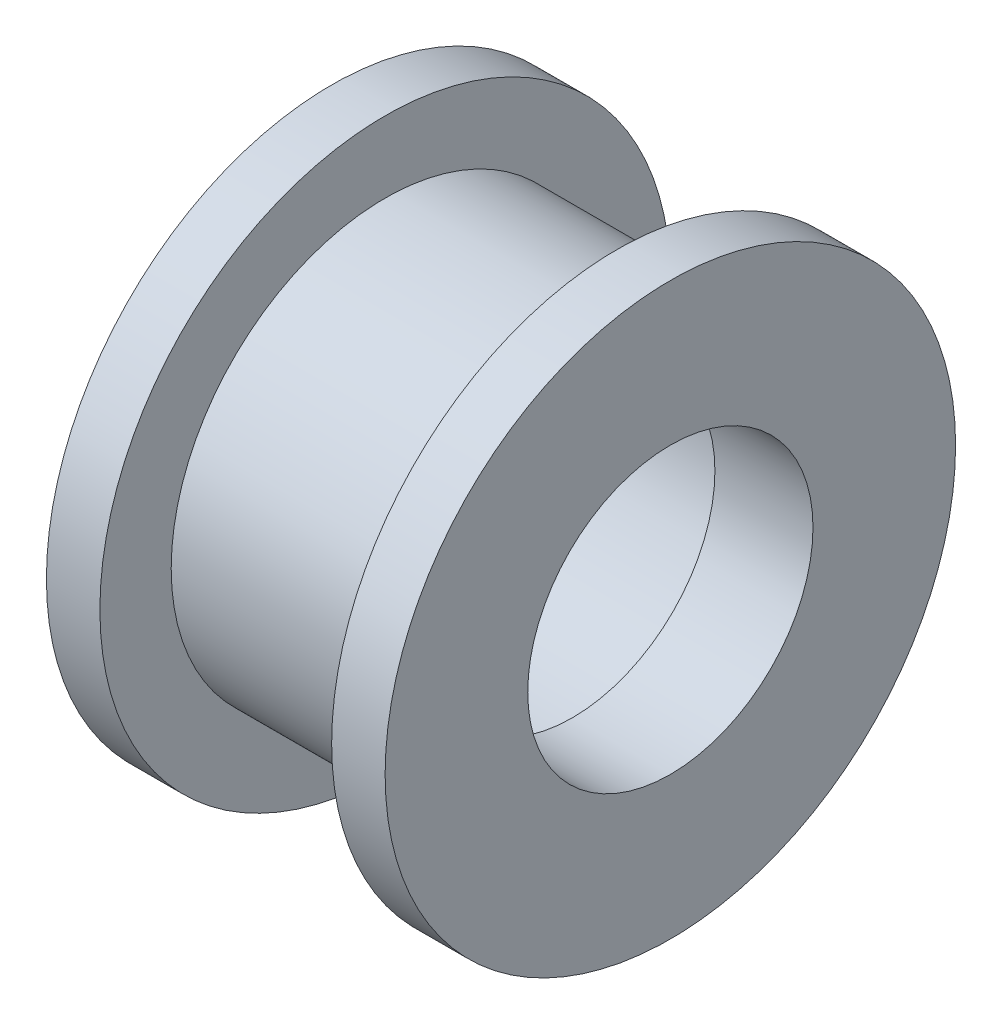
ISO-10303-21;
HEADER;
FILE_DESCRIPTION(('STEP AP214'),'2;1');
FILE_NAME('part.step','',(''),(''),'','','');
FILE_SCHEMA(('AUTOMOTIVE_DESIGN { 1 0 10303 214 1 1 1 1 }'));
ENDSEC;
DATA;
#1=APPLICATION_CONTEXT('core data for automotive mechanical design processes');
#2=APPLICATION_PROTOCOL_DEFINITION('international standard','automotive_design',2000,#1);
#3=PRODUCT_CONTEXT('',#1,'mechanical');
#4=PRODUCT('Part','Part','',(#3));
#5=PRODUCT_RELATED_PRODUCT_CATEGORY('part','',(#4));
#6=PRODUCT_DEFINITION_FORMATION('','',#4);
#7=PRODUCT_DEFINITION_CONTEXT('part definition',#1,'design');
#8=PRODUCT_DEFINITION('design','',#6,#7);
#9=PRODUCT_DEFINITION_SHAPE('','',#8);
#10=(LENGTH_UNIT() NAMED_UNIT(*) SI_UNIT(.MILLI.,.METRE.));
#11=(NAMED_UNIT(*) PLANE_ANGLE_UNIT() SI_UNIT($,.RADIAN.));
#12=(NAMED_UNIT(*) SI_UNIT($,.STERADIAN.) SOLID_ANGLE_UNIT());
#13=UNCERTAINTY_MEASURE_WITH_UNIT(LENGTH_MEASURE(1.E-05),#10,'distance_accuracy_value','');
#14=(GEOMETRIC_REPRESENTATION_CONTEXT(3) GLOBAL_UNCERTAINTY_ASSIGNED_CONTEXT((#13)) GLOBAL_UNIT_ASSIGNED_CONTEXT((#10,
#11,#12)) REPRESENTATION_CONTEXT('',''));
#15=CARTESIAN_POINT('',(0.,0.,0.));
#16=DIRECTION('',(0.,0.,1.));
#17=DIRECTION('',(1.,0.,0.));
#18=AXIS2_PLACEMENT_3D('',#15,#16,#17);
#19=CARTESIAN_POINT('',(-5.5,8.,0.));
#20=DIRECTION('',(1.,0.,0.));
#21=DIRECTION('',(0.,0.,-1.));
#22=AXIS2_PLACEMENT_3D('',#19,#20,#21);
#23=PLANE('',#22);
#24=CARTESIAN_POINT('',(-5.5,0.,0.));
#25=DIRECTION('',(-1.,0.,0.));
#26=DIRECTION('',(0.,0.,1.));
#27=AXIS2_PLACEMENT_3D('',#24,#25,#26);
#28=CIRCLE('',#27,4.975);
#29=CARTESIAN_POINT('',(-5.5,0.,4.975));
#30=VERTEX_POINT('',#29);
#31=EDGE_CURVE('E10',#30,#30,#28,.T.);
#32=ORIENTED_EDGE('',*,*,#31,.F.);
#33=EDGE_LOOP('',(#32));
#34=FACE_BOUND('',#33,.T.);
#35=CARTESIAN_POINT('',(-5.5,0.,0.));
#36=DIRECTION('',(-1.,0.,0.));
#37=DIRECTION('',(0.,0.,1.));
#38=AXIS2_PLACEMENT_3D('',#35,#36,#37);
#39=CIRCLE('',#38,8.);
#40=CARTESIAN_POINT('',(-5.5,0.,8.));
#41=VERTEX_POINT('',#40);
#42=EDGE_CURVE('E64',#41,#41,#39,.T.);
#43=ORIENTED_EDGE('',*,*,#42,.T.);
#44=EDGE_LOOP('',(#43));
#45=FACE_BOUND('',#44,.T.);
#46=ADVANCED_FACE('F30',(#34,#45),#23,.F.);
#47=CARTESIAN_POINT('',(-17.3034482758621,0.,0.));
#48=DIRECTION('',(-1.,0.,0.));
#49=DIRECTION('',(0.,0.,1.));
#50=AXIS2_PLACEMENT_3D('',#47,#48,#49);
#51=CYLINDRICAL_SURFACE('',#50,4.975);
#52=CARTESIAN_POINT('',(1.25,0.,0.));
#53=DIRECTION('',(-1.,0.,0.));
#54=DIRECTION('',(0.,0.,1.));
#55=AXIS2_PLACEMENT_3D('',#52,#53,#54);
#56=CIRCLE('',#55,4.975);
#57=CARTESIAN_POINT('',(1.25,0.,4.975));
#58=VERTEX_POINT('',#57);
#59=EDGE_CURVE('E36',#58,#58,#56,.T.);
#60=ORIENTED_EDGE('',*,*,#59,.F.);
#61=EDGE_LOOP('',(#60));
#62=FACE_BOUND('',#61,.T.);
#63=ORIENTED_EDGE('',*,*,#31,.T.);
#64=EDGE_LOOP('',(#63));
#65=FACE_BOUND('',#64,.T.);
#66=ADVANCED_FACE('F113',(#62,#65),#51,.F.);
#67=CARTESIAN_POINT('',(1.25,4.,0.));
#68=DIRECTION('',(1.,0.,0.));
#69=DIRECTION('',(0.,0.,-1.));
#70=AXIS2_PLACEMENT_3D('',#67,#68,#69);
#71=PLANE('',#70);
#72=CARTESIAN_POINT('',(1.25,0.,0.));
#73=DIRECTION('',(-1.,0.,0.));
#74=DIRECTION('',(0.,0.,1.));
#75=AXIS2_PLACEMENT_3D('',#72,#73,#74);
#76=CIRCLE('',#75,4.);
#77=CARTESIAN_POINT('',(1.25,0.,4.));
#78=VERTEX_POINT('',#77);
#79=EDGE_CURVE('E40',#78,#78,#76,.T.);
#80=ORIENTED_EDGE('',*,*,#79,.F.);
#81=EDGE_LOOP('',(#80));
#82=FACE_BOUND('',#81,.T.);
#83=ORIENTED_EDGE('',*,*,#59,.T.);
#84=EDGE_LOOP('',(#83));
#85=FACE_BOUND('',#84,.T.);
#86=ADVANCED_FACE('F108',(#82,#85),#71,.F.);
#87=CARTESIAN_POINT('',(-17.3034482758621,0.,0.));
#88=DIRECTION('',(-1.,0.,0.));
#89=DIRECTION('',(0.,0.,1.));
#90=AXIS2_PLACEMENT_3D('',#87,#88,#89);
#91=CYLINDRICAL_SURFACE('',#90,4.);
#92=CARTESIAN_POINT('',(4.,0.,0.));
#93=DIRECTION('',(-1.,0.,0.));
#94=DIRECTION('',(0.,0.,1.));
#95=AXIS2_PLACEMENT_3D('',#92,#93,#94);
#96=CIRCLE('',#95,4.);
#97=CARTESIAN_POINT('',(4.,0.,4.));
#98=VERTEX_POINT('',#97);
#99=EDGE_CURVE('E44',#98,#98,#96,.T.);
#100=ORIENTED_EDGE('',*,*,#99,.F.);
#101=EDGE_LOOP('',(#100));
#102=FACE_BOUND('',#101,.T.);
#103=ORIENTED_EDGE('',*,*,#79,.T.);
#104=EDGE_LOOP('',(#103));
#105=FACE_BOUND('',#104,.T.);
#106=ADVANCED_FACE('F102',(#102,#105),#91,.F.);
#107=CARTESIAN_POINT('',(4.,4.,0.));
#108=DIRECTION('',(-1.,0.,0.));
#109=DIRECTION('',(0.,0.,1.));
#110=AXIS2_PLACEMENT_3D('',#107,#108,#109);
#111=PLANE('',#110);
#112=CARTESIAN_POINT('',(4.,0.,0.));
#113=DIRECTION('',(-1.,0.,0.));
#114=DIRECTION('',(0.,0.,1.));
#115=AXIS2_PLACEMENT_3D('',#112,#113,#114);
#116=CIRCLE('',#115,8.);
#117=CARTESIAN_POINT('',(4.,0.,8.));
#118=VERTEX_POINT('',#117);
#119=EDGE_CURVE('E49',#118,#118,#116,.T.);
#120=ORIENTED_EDGE('',*,*,#119,.F.);
#121=EDGE_LOOP('',(#120));
#122=FACE_BOUND('',#121,.T.);
#123=ORIENTED_EDGE('',*,*,#99,.T.);
#124=EDGE_LOOP('',(#123));
#125=FACE_BOUND('',#124,.T.);
#126=ADVANCED_FACE('F96',(#122,#125),#111,.F.);
#127=CARTESIAN_POINT('',(-17.3034482758621,0.,0.));
#128=DIRECTION('',(-1.,0.,0.));
#129=DIRECTION('',(0.,0.,1.));
#130=AXIS2_PLACEMENT_3D('',#127,#128,#129);
#131=CYLINDRICAL_SURFACE('',#130,8.);
#132=CARTESIAN_POINT('',(2.5,0.,0.));
#133=DIRECTION('',(-1.,0.,0.));
#134=DIRECTION('',(0.,0.,1.));
#135=AXIS2_PLACEMENT_3D('',#132,#133,#134);
#136=CIRCLE('',#135,8.);
#137=CARTESIAN_POINT('',(2.5,0.,8.));
#138=VERTEX_POINT('',#137);
#139=EDGE_CURVE('E52',#138,#138,#136,.T.);
#140=ORIENTED_EDGE('',*,*,#139,.F.);
#141=EDGE_LOOP('',(#140));
#142=FACE_BOUND('',#141,.T.);
#143=ORIENTED_EDGE('',*,*,#119,.T.);
#144=EDGE_LOOP('',(#143));
#145=FACE_BOUND('',#144,.T.);
#146=ADVANCED_FACE('F90',(#142,#145),#131,.T.);
#147=CARTESIAN_POINT('',(2.5,8.,0.));
#148=DIRECTION('',(1.,0.,0.));
#149=DIRECTION('',(0.,0.,-1.));
#150=AXIS2_PLACEMENT_3D('',#147,#148,#149);
#151=PLANE('',#150);
#152=CARTESIAN_POINT('',(2.5,0.,0.));
#153=DIRECTION('',(-1.,0.,0.));
#154=DIRECTION('',(0.,0.,1.));
#155=AXIS2_PLACEMENT_3D('',#152,#153,#154);
#156=CIRCLE('',#155,6.);
#157=CARTESIAN_POINT('',(2.5,0.,6.));
#158=VERTEX_POINT('',#157);
#159=EDGE_CURVE('E55',#158,#158,#156,.T.);
#160=ORIENTED_EDGE('',*,*,#159,.F.);
#161=EDGE_LOOP('',(#160));
#162=FACE_BOUND('',#161,.T.);
#163=ORIENTED_EDGE('',*,*,#139,.T.);
#164=EDGE_LOOP('',(#163));
#165=FACE_BOUND('',#164,.T.);
#166=ADVANCED_FACE('F84',(#162,#165),#151,.F.);
#167=CARTESIAN_POINT('',(-17.3034482758621,0.,0.));
#168=DIRECTION('',(-1.,0.,0.));
#169=DIRECTION('',(0.,0.,1.));
#170=AXIS2_PLACEMENT_3D('',#167,#168,#169);
#171=CYLINDRICAL_SURFACE('',#170,6.);
#172=CARTESIAN_POINT('',(-4.,0.,0.));
#173=DIRECTION('',(-1.,0.,0.));
#174=DIRECTION('',(0.,0.,1.));
#175=AXIS2_PLACEMENT_3D('',#172,#173,#174);
#176=CIRCLE('',#175,6.);
#177=CARTESIAN_POINT('',(-4.,0.,6.));
#178=VERTEX_POINT('',#177);
#179=EDGE_CURVE('E58',#178,#178,#176,.T.);
#180=ORIENTED_EDGE('',*,*,#179,.F.);
#181=EDGE_LOOP('',(#180));
#182=FACE_BOUND('',#181,.T.);
#183=ORIENTED_EDGE('',*,*,#159,.T.);
#184=EDGE_LOOP('',(#183));
#185=FACE_BOUND('',#184,.T.);
#186=ADVANCED_FACE('F78',(#182,#185),#171,.T.);
#187=CARTESIAN_POINT('',(-4.,6.,0.));
#188=DIRECTION('',(-1.,0.,0.));
#189=DIRECTION('',(0.,0.,1.));
#190=AXIS2_PLACEMENT_3D('',#187,#188,#189);
#191=PLANE('',#190);
#192=CARTESIAN_POINT('',(-4.,0.,0.));
#193=DIRECTION('',(-1.,0.,0.));
#194=DIRECTION('',(0.,0.,1.));
#195=AXIS2_PLACEMENT_3D('',#192,#193,#194);
#196=CIRCLE('',#195,8.);
#197=CARTESIAN_POINT('',(-4.,0.,8.));
#198=VERTEX_POINT('',#197);
#199=EDGE_CURVE('E61',#198,#198,#196,.T.);
#200=ORIENTED_EDGE('',*,*,#199,.F.);
#201=EDGE_LOOP('',(#200));
#202=FACE_BOUND('',#201,.T.);
#203=ORIENTED_EDGE('',*,*,#179,.T.);
#204=EDGE_LOOP('',(#203));
#205=FACE_BOUND('',#204,.T.);
#206=ADVANCED_FACE('F72',(#202,#205),#191,.F.);
#207=CARTESIAN_POINT('',(-17.3034482758621,0.,0.));
#208=DIRECTION('',(-1.,0.,0.));
#209=DIRECTION('',(0.,0.,1.));
#210=AXIS2_PLACEMENT_3D('',#207,#208,#209);
#211=CYLINDRICAL_SURFACE('',#210,8.);
#212=ORIENTED_EDGE('',*,*,#42,.F.);
#213=EDGE_LOOP('',(#212));
#214=FACE_BOUND('',#213,.T.);
#215=ORIENTED_EDGE('',*,*,#199,.T.);
#216=EDGE_LOOP('',(#215));
#217=FACE_BOUND('',#216,.T.);
#218=ADVANCED_FACE('F69',(#214,#217),#211,.T.);
#219=CLOSED_SHELL('',(#46,#66,#86,#106,#126,#146,#166,#186,#206,#218));
#220=MANIFOLD_SOLID_BREP('B2',#219);
#221=ADVANCED_BREP_SHAPE_REPRESENTATION('',(#18,#220),#14);
#222=SHAPE_DEFINITION_REPRESENTATION(#9,#221);
ENDSEC;
END-ISO-10303-21;
